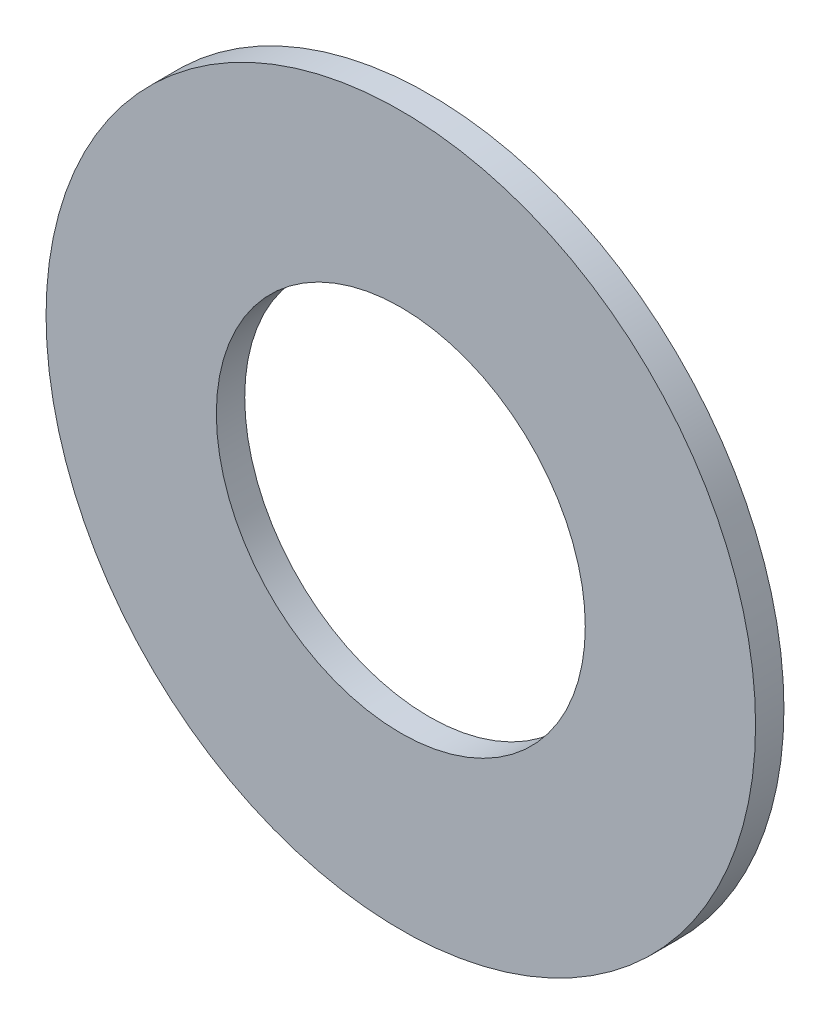
ISO-10303-21;
HEADER;
FILE_DESCRIPTION(('STEP AP214'),'2;1');
FILE_NAME('part.step','',(''),(''),'','','');
FILE_SCHEMA(('AUTOMOTIVE_DESIGN { 1 0 10303 214 1 1 1 1 }'));
ENDSEC;
DATA;
#1=APPLICATION_CONTEXT('core data for automotive mechanical design processes');
#2=APPLICATION_PROTOCOL_DEFINITION('international standard','automotive_design',2000,#1);
#3=PRODUCT_CONTEXT('',#1,'mechanical');
#4=PRODUCT('Part','Part','',(#3));
#5=PRODUCT_RELATED_PRODUCT_CATEGORY('part','',(#4));
#6=PRODUCT_DEFINITION_FORMATION('','',#4);
#7=PRODUCT_DEFINITION_CONTEXT('part definition',#1,'design');
#8=PRODUCT_DEFINITION('design','',#6,#7);
#9=PRODUCT_DEFINITION_SHAPE('','',#8);
#10=(LENGTH_UNIT() NAMED_UNIT(*) SI_UNIT(.MILLI.,.METRE.));
#11=(NAMED_UNIT(*) PLANE_ANGLE_UNIT() SI_UNIT($,.RADIAN.));
#12=(NAMED_UNIT(*) SI_UNIT($,.STERADIAN.) SOLID_ANGLE_UNIT());
#13=UNCERTAINTY_MEASURE_WITH_UNIT(LENGTH_MEASURE(1.E-05),#10,'distance_accuracy_value','');
#14=(GEOMETRIC_REPRESENTATION_CONTEXT(3) GLOBAL_UNCERTAINTY_ASSIGNED_CONTEXT((#13)) GLOBAL_UNIT_ASSIGNED_CONTEXT((#10,
#11,#12)) REPRESENTATION_CONTEXT('',''));
#15=CARTESIAN_POINT('',(0.,0.,0.));
#16=DIRECTION('',(0.,0.,1.));
#17=DIRECTION('',(1.,0.,0.));
#18=AXIS2_PLACEMENT_3D('',#15,#16,#17);
#19=CARTESIAN_POINT('',(0.,0.,-0.508));
#20=DIRECTION('',(0.,0.,1.));
#21=DIRECTION('',(1.,0.,0.));
#22=AXIS2_PLACEMENT_3D('',#19,#20,#21);
#23=CYLINDRICAL_SURFACE('',#22,6.35);
#24=CARTESIAN_POINT('',(0.,0.,-0.508));
#25=DIRECTION('',(0.,0.,1.));
#26=DIRECTION('',(1.,0.,0.));
#27=AXIS2_PLACEMENT_3D('',#24,#25,#26);
#28=CIRCLE('',#27,6.35);
#29=CARTESIAN_POINT('',(6.35,0.,-0.508));
#30=VERTEX_POINT('',#29);
#31=EDGE_CURVE('E10',#30,#30,#28,.T.);
#32=ORIENTED_EDGE('',*,*,#31,.T.);
#33=EDGE_LOOP('',(#32));
#34=FACE_BOUND('',#33,.T.);
#35=CARTESIAN_POINT('',(0.,0.,0.));
#36=DIRECTION('',(0.,0.,1.));
#37=DIRECTION('',(1.,0.,0.));
#38=AXIS2_PLACEMENT_3D('',#35,#36,#37);
#39=CIRCLE('',#38,6.35);
#40=CARTESIAN_POINT('',(6.35,0.,0.));
#41=VERTEX_POINT('',#40);
#42=EDGE_CURVE('E33',#41,#41,#39,.T.);
#43=ORIENTED_EDGE('',*,*,#42,.F.);
#44=EDGE_LOOP('',(#43));
#45=FACE_BOUND('',#44,.T.);
#46=ADVANCED_FACE('F30',(#34,#45),#23,.T.);
#47=CARTESIAN_POINT('',(0.,0.,-0.508));
#48=DIRECTION('',(0.,0.,1.));
#49=DIRECTION('',(1.,0.,0.));
#50=AXIS2_PLACEMENT_3D('',#47,#48,#49);
#51=PLANE('',#50);
#52=CARTESIAN_POINT('',(0.,0.,-0.508));
#53=DIRECTION('',(0.,0.,1.));
#54=DIRECTION('',(1.,0.,0.));
#55=AXIS2_PLACEMENT_3D('',#52,#53,#54);
#56=CIRCLE('',#55,3.302);
#57=CARTESIAN_POINT('',(3.302,0.,-0.508));
#58=VERTEX_POINT('',#57);
#59=EDGE_CURVE('E40',#58,#58,#56,.T.);
#60=ORIENTED_EDGE('',*,*,#59,.T.);
#61=EDGE_LOOP('',(#60));
#62=FACE_BOUND('',#61,.T.);
#63=ORIENTED_EDGE('',*,*,#31,.F.);
#64=EDGE_LOOP('',(#63));
#65=FACE_BOUND('',#64,.T.);
#66=ADVANCED_FACE('F48',(#62,#65),#51,.F.);
#67=CARTESIAN_POINT('',(0.,0.,0.));
#68=DIRECTION('',(0.,0.,1.));
#69=DIRECTION('',(1.,0.,0.));
#70=AXIS2_PLACEMENT_3D('',#67,#68,#69);
#71=PLANE('',#70);
#72=CARTESIAN_POINT('',(0.,0.,0.));
#73=DIRECTION('',(0.,0.,1.));
#74=DIRECTION('',(1.,0.,0.));
#75=AXIS2_PLACEMENT_3D('',#72,#73,#74);
#76=CIRCLE('',#75,3.302);
#77=CARTESIAN_POINT('',(3.302,0.,0.));
#78=VERTEX_POINT('',#77);
#79=EDGE_CURVE('E42',#78,#78,#76,.T.);
#80=ORIENTED_EDGE('',*,*,#79,.F.);
#81=EDGE_LOOP('',(#80));
#82=FACE_BOUND('',#81,.T.);
#83=ORIENTED_EDGE('',*,*,#42,.T.);
#84=EDGE_LOOP('',(#83));
#85=FACE_BOUND('',#84,.T.);
#86=ADVANCED_FACE('F54',(#82,#85),#71,.T.);
#87=CARTESIAN_POINT('',(0.,0.,-0.508));
#88=DIRECTION('',(0.,0.,1.));
#89=DIRECTION('',(1.,0.,0.));
#90=AXIS2_PLACEMENT_3D('',#87,#88,#89);
#91=CYLINDRICAL_SURFACE('',#90,3.302);
#92=ORIENTED_EDGE('',*,*,#59,.F.);
#93=EDGE_LOOP('',(#92));
#94=FACE_BOUND('',#93,.T.);
#95=ORIENTED_EDGE('',*,*,#79,.T.);
#96=EDGE_LOOP('',(#95));
#97=FACE_BOUND('',#96,.T.);
#98=ADVANCED_FACE('F51',(#94,#97),#91,.F.);
#99=CLOSED_SHELL('',(#46,#66,#86,#98));
#100=MANIFOLD_SOLID_BREP('B2',#99);
#101=ADVANCED_BREP_SHAPE_REPRESENTATION('',(#18,#100),#14);
#102=SHAPE_DEFINITION_REPRESENTATION(#9,#101);
ENDSEC;
END-ISO-10303-21;
